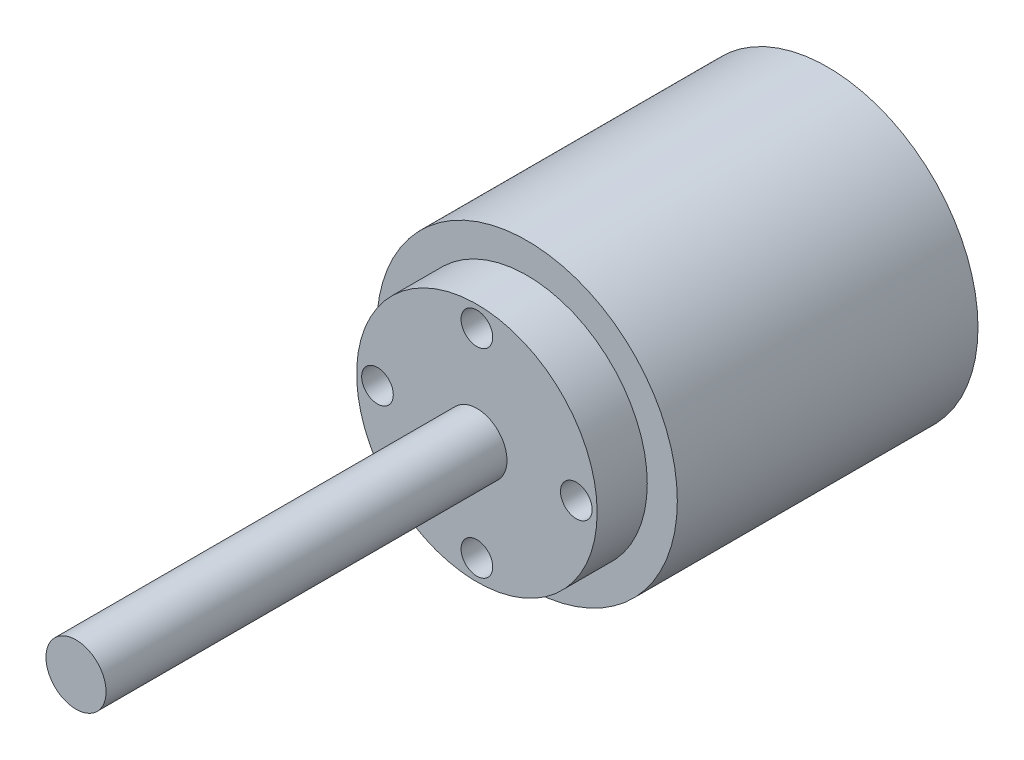
ISO-10303-21;
HEADER;
FILE_DESCRIPTION(('STEP AP214'),'2;1');
FILE_NAME('part.step','',(''),(''),'','','');
FILE_SCHEMA(('AUTOMOTIVE_DESIGN { 1 0 10303 214 1 1 1 1 }'));
ENDSEC;
DATA;
#1=APPLICATION_CONTEXT('core data for automotive mechanical design processes');
#2=APPLICATION_PROTOCOL_DEFINITION('international standard','automotive_design',2000,#1);
#3=PRODUCT_CONTEXT('',#1,'mechanical');
#4=PRODUCT('Part','Part','',(#3));
#5=PRODUCT_RELATED_PRODUCT_CATEGORY('part','',(#4));
#6=PRODUCT_DEFINITION_FORMATION('','',#4);
#7=PRODUCT_DEFINITION_CONTEXT('part definition',#1,'design');
#8=PRODUCT_DEFINITION('design','',#6,#7);
#9=PRODUCT_DEFINITION_SHAPE('','',#8);
#10=(LENGTH_UNIT() NAMED_UNIT(*) SI_UNIT(.MILLI.,.METRE.));
#11=(NAMED_UNIT(*) PLANE_ANGLE_UNIT() SI_UNIT($,.RADIAN.));
#12=(NAMED_UNIT(*) SI_UNIT($,.STERADIAN.) SOLID_ANGLE_UNIT());
#13=UNCERTAINTY_MEASURE_WITH_UNIT(LENGTH_MEASURE(1.E-05),#10,'distance_accuracy_value','');
#14=(GEOMETRIC_REPRESENTATION_CONTEXT(3) GLOBAL_UNCERTAINTY_ASSIGNED_CONTEXT((#13)) GLOBAL_UNIT_ASSIGNED_CONTEXT((#10,
#11,#12)) REPRESENTATION_CONTEXT('',''));
#15=CARTESIAN_POINT('',(0.,0.,0.));
#16=DIRECTION('',(0.,0.,1.));
#17=DIRECTION('',(1.,0.,0.));
#18=AXIS2_PLACEMENT_3D('',#15,#16,#17);
#19=CARTESIAN_POINT('',(5.17868932497556,-6.92509433962264,35.));
#20=DIRECTION('',(0.,0.,1.));
#21=DIRECTION('',(1.,0.,0.));
#22=AXIS2_PLACEMENT_3D('',#19,#20,#21);
#23=PLANE('',#22);
#24=CARTESIAN_POINT('',(5.17868932497556,-6.92509433962264,35.));
#25=DIRECTION('',(0.,0.,1.));
#26=DIRECTION('',(1.,0.,0.));
#27=AXIS2_PLACEMENT_3D('',#24,#25,#26);
#28=CIRCLE('',#27,12.);
#29=CARTESIAN_POINT('',(17.1786893249756,-6.92509433962264,35.));
#30=VERTEX_POINT('',#29);
#31=EDGE_CURVE('E44',#30,#30,#28,.T.);
#32=ORIENTED_EDGE('',*,*,#31,.T.);
#33=EDGE_LOOP('',(#32));
#34=FACE_BOUND('',#33,.T.);
#35=CARTESIAN_POINT('',(5.17868932497556,2.99560998384455,35.));
#36=DIRECTION('',(0.,0.,1.));
#37=DIRECTION('',(1.,0.,0.));
#38=AXIS2_PLACEMENT_3D('',#35,#36,#37);
#39=CIRCLE('',#38,1.5792956765328);
#40=CARTESIAN_POINT('',(6.75798500150836,2.99560998384455,35.));
#41=VERTEX_POINT('',#40);
#42=EDGE_CURVE('E52',#41,#41,#39,.T.);
#43=ORIENTED_EDGE('',*,*,#42,.F.);
#44=EDGE_LOOP('',(#43));
#45=FACE_BOUND('',#44,.T.);
#46=CARTESIAN_POINT('',(15.0993936484429,-6.92509433962254,35.));
#47=DIRECTION('',(0.,0.,1.));
#48=DIRECTION('',(1.,0.,0.));
#49=AXIS2_PLACEMENT_3D('',#46,#47,#48);
#50=CIRCLE('',#49,1.5792956765328);
#51=CARTESIAN_POINT('',(16.6786893249757,-6.92509433962254,35.));
#52=VERTEX_POINT('',#51);
#53=EDGE_CURVE('E58',#52,#52,#50,.T.);
#54=ORIENTED_EDGE('',*,*,#53,.F.);
#55=EDGE_LOOP('',(#54));
#56=FACE_BOUND('',#55,.T.);
#57=CARTESIAN_POINT('',(5.17868932497577,-16.8457986630898,35.));
#58=DIRECTION('',(0.,0.,1.));
#59=DIRECTION('',(1.,0.,0.));
#60=AXIS2_PLACEMENT_3D('',#57,#58,#59);
#61=CIRCLE('',#60,1.5792956765328);
#62=CARTESIAN_POINT('',(6.75798500150857,-16.8457986630898,35.));
#63=VERTEX_POINT('',#62);
#64=EDGE_CURVE('E64',#63,#63,#61,.T.);
#65=ORIENTED_EDGE('',*,*,#64,.F.);
#66=EDGE_LOOP('',(#65));
#67=FACE_BOUND('',#66,.T.);
#68=CARTESIAN_POINT('',(-4.7420149984915,-6.92509433962268,35.));
#69=DIRECTION('',(0.,0.,1.));
#70=DIRECTION('',(1.,0.,0.));
#71=AXIS2_PLACEMENT_3D('',#68,#69,#70);
#72=CIRCLE('',#71,1.5792956765328);
#73=CARTESIAN_POINT('',(-3.1627193219587,-6.92509433962268,35.));
#74=VERTEX_POINT('',#73);
#75=EDGE_CURVE('E70',#74,#74,#72,.T.);
#76=ORIENTED_EDGE('',*,*,#75,.F.);
#77=EDGE_LOOP('',(#76));
#78=FACE_BOUND('',#77,.T.);
#79=CARTESIAN_POINT('',(5.17868932497556,-6.92509433962264,35.));
#80=DIRECTION('',(0.,0.,1.));
#81=DIRECTION('',(1.,0.,0.));
#82=AXIS2_PLACEMENT_3D('',#79,#80,#81);
#83=CIRCLE('',#82,3.);
#84=CARTESIAN_POINT('',(8.17868932497556,-6.92509433962264,35.));
#85=VERTEX_POINT('',#84);
#86=EDGE_CURVE('E76',#85,#85,#83,.T.);
#87=ORIENTED_EDGE('',*,*,#86,.F.);
#88=EDGE_LOOP('',(#87));
#89=FACE_BOUND('',#88,.T.);
#90=ADVANCED_FACE('F33',(#34,#45,#56,#67,#78,#89),#23,.T.);
#91=CARTESIAN_POINT('',(5.17868932497556,-6.92509433962264,30.));
#92=DIRECTION('',(0.,0.,1.));
#93=DIRECTION('',(1.,0.,0.));
#94=AXIS2_PLACEMENT_3D('',#91,#92,#93);
#95=PLANE('',#94);
#96=CARTESIAN_POINT('',(5.17868932497556,-6.92509433962264,30.));
#97=DIRECTION('',(0.,0.,1.));
#98=DIRECTION('',(1.,0.,0.));
#99=AXIS2_PLACEMENT_3D('',#96,#97,#98);
#100=CIRCLE('',#99,15.);
#101=CARTESIAN_POINT('',(20.1786893249756,-6.92509433962264,30.));
#102=VERTEX_POINT('',#101);
#103=EDGE_CURVE('E10',#102,#102,#100,.T.);
#104=ORIENTED_EDGE('',*,*,#103,.T.);
#105=EDGE_LOOP('',(#104));
#106=FACE_BOUND('',#105,.T.);
#107=CARTESIAN_POINT('',(5.17868932497556,-6.92509433962264,30.));
#108=DIRECTION('',(0.,0.,1.));
#109=DIRECTION('',(1.,0.,0.));
#110=AXIS2_PLACEMENT_3D('',#107,#108,#109);
#111=CIRCLE('',#110,12.);
#112=CARTESIAN_POINT('',(17.1786893249756,-6.92509433962264,30.));
#113=VERTEX_POINT('',#112);
#114=EDGE_CURVE('E46',#113,#113,#111,.T.);
#115=ORIENTED_EDGE('',*,*,#114,.F.);
#116=EDGE_LOOP('',(#115));
#117=FACE_BOUND('',#116,.T.);
#118=ADVANCED_FACE('F92',(#106,#117),#95,.T.);
#119=CARTESIAN_POINT('',(5.17868932497556,-6.92509433962264,30.));
#120=DIRECTION('',(0.,0.,-1.));
#121=DIRECTION('',(-1.,0.,0.));
#122=AXIS2_PLACEMENT_3D('',#119,#120,#121);
#123=CYLINDRICAL_SURFACE('',#122,15.);
#124=ORIENTED_EDGE('',*,*,#103,.F.);
#125=EDGE_LOOP('',(#124));
#126=FACE_BOUND('',#125,.T.);
#127=CARTESIAN_POINT('',(5.17868932497556,-6.92509433962264,0.));
#128=DIRECTION('',(0.,0.,1.));
#129=DIRECTION('',(1.,0.,0.));
#130=AXIS2_PLACEMENT_3D('',#127,#128,#129);
#131=CIRCLE('',#130,15.);
#132=CARTESIAN_POINT('',(20.1786893249756,-6.92509433962264,0.));
#133=VERTEX_POINT('',#132);
#134=EDGE_CURVE('E37',#133,#133,#131,.T.);
#135=ORIENTED_EDGE('',*,*,#134,.T.);
#136=EDGE_LOOP('',(#135));
#137=FACE_BOUND('',#136,.T.);
#138=ADVANCED_FACE('F35',(#126,#137),#123,.T.);
#139=CARTESIAN_POINT('',(5.17868932497556,-6.92509433962264,0.));
#140=DIRECTION('',(0.,0.,1.));
#141=DIRECTION('',(1.,0.,0.));
#142=AXIS2_PLACEMENT_3D('',#139,#140,#141);
#143=PLANE('',#142);
#144=ORIENTED_EDGE('',*,*,#134,.F.);
#145=EDGE_LOOP('',(#144));
#146=FACE_BOUND('',#145,.T.);
#147=ADVANCED_FACE('F106',(#146),#143,.F.);
#148=CARTESIAN_POINT('',(5.17868932497556,-6.92509433962264,35.));
#149=DIRECTION('',(0.,0.,-1.));
#150=DIRECTION('',(-1.,0.,0.));
#151=AXIS2_PLACEMENT_3D('',#148,#149,#150);
#152=CYLINDRICAL_SURFACE('',#151,12.);
#153=ORIENTED_EDGE('',*,*,#31,.F.);
#154=EDGE_LOOP('',(#153));
#155=FACE_BOUND('',#154,.T.);
#156=ORIENTED_EDGE('',*,*,#114,.T.);
#157=EDGE_LOOP('',(#156));
#158=FACE_BOUND('',#157,.T.);
#159=ADVANCED_FACE('F104',(#155,#158),#152,.T.);
#160=CARTESIAN_POINT('',(5.17868932497556,2.99560998384455,32.));
#161=DIRECTION('',(0.,0.,1.));
#162=DIRECTION('',(1.,0.,0.));
#163=AXIS2_PLACEMENT_3D('',#160,#161,#162);
#164=CYLINDRICAL_SURFACE('',#163,1.5792956765328);
#165=CARTESIAN_POINT('',(5.17868932497556,2.99560998384455,32.));
#166=DIRECTION('',(0.,0.,1.));
#167=DIRECTION('',(1.,0.,0.));
#168=AXIS2_PLACEMENT_3D('',#165,#166,#167);
#169=CIRCLE('',#168,1.5792956765328);
#170=CARTESIAN_POINT('',(6.75798500150836,2.99560998384455,32.));
#171=VERTEX_POINT('',#170);
#172=EDGE_CURVE('E49',#171,#171,#169,.T.);
#173=ORIENTED_EDGE('',*,*,#172,.F.);
#174=EDGE_LOOP('',(#173));
#175=FACE_BOUND('',#174,.T.);
#176=ORIENTED_EDGE('',*,*,#42,.T.);
#177=EDGE_LOOP('',(#176));
#178=FACE_BOUND('',#177,.T.);
#179=ADVANCED_FACE('F102',(#175,#178),#164,.F.);
#180=CARTESIAN_POINT('',(5.17868932497556,2.99560998384455,32.));
#181=DIRECTION('',(0.,0.,1.));
#182=DIRECTION('',(1.,0.,0.));
#183=AXIS2_PLACEMENT_3D('',#180,#181,#182);
#184=PLANE('',#183);
#185=ORIENTED_EDGE('',*,*,#172,.T.);
#186=EDGE_LOOP('',(#185));
#187=FACE_BOUND('',#186,.T.);
#188=ADVANCED_FACE('F140',(#187),#184,.T.);
#189=CARTESIAN_POINT('',(15.0993936484429,-6.92509433962254,32.));
#190=DIRECTION('',(0.,0.,1.));
#191=DIRECTION('',(1.,0.,0.));
#192=AXIS2_PLACEMENT_3D('',#189,#190,#191);
#193=CYLINDRICAL_SURFACE('',#192,1.5792956765328);
#194=CARTESIAN_POINT('',(15.0993936484429,-6.92509433962254,32.));
#195=DIRECTION('',(0.,0.,1.));
#196=DIRECTION('',(1.,0.,0.));
#197=AXIS2_PLACEMENT_3D('',#194,#195,#196);
#198=CIRCLE('',#197,1.5792956765328);
#199=CARTESIAN_POINT('',(16.6786893249757,-6.92509433962254,32.));
#200=VERTEX_POINT('',#199);
#201=EDGE_CURVE('E55',#200,#200,#198,.T.);
#202=ORIENTED_EDGE('',*,*,#201,.F.);
#203=EDGE_LOOP('',(#202));
#204=FACE_BOUND('',#203,.T.);
#205=ORIENTED_EDGE('',*,*,#53,.T.);
#206=EDGE_LOOP('',(#205));
#207=FACE_BOUND('',#206,.T.);
#208=ADVANCED_FACE('F149',(#204,#207),#193,.F.);
#209=CARTESIAN_POINT('',(15.0993936484429,-6.92509433962254,32.));
#210=DIRECTION('',(0.,0.,1.));
#211=DIRECTION('',(1.,0.,0.));
#212=AXIS2_PLACEMENT_3D('',#209,#210,#211);
#213=PLANE('',#212);
#214=ORIENTED_EDGE('',*,*,#201,.T.);
#215=EDGE_LOOP('',(#214));
#216=FACE_BOUND('',#215,.T.);
#217=ADVANCED_FACE('F158',(#216),#213,.T.);
#218=CARTESIAN_POINT('',(5.17868932497577,-16.8457986630898,32.));
#219=DIRECTION('',(0.,0.,1.));
#220=DIRECTION('',(1.,0.,0.));
#221=AXIS2_PLACEMENT_3D('',#218,#219,#220);
#222=CYLINDRICAL_SURFACE('',#221,1.5792956765328);
#223=CARTESIAN_POINT('',(5.17868932497577,-16.8457986630898,32.));
#224=DIRECTION('',(0.,0.,1.));
#225=DIRECTION('',(1.,0.,0.));
#226=AXIS2_PLACEMENT_3D('',#223,#224,#225);
#227=CIRCLE('',#226,1.5792956765328);
#228=CARTESIAN_POINT('',(6.75798500150857,-16.8457986630898,32.));
#229=VERTEX_POINT('',#228);
#230=EDGE_CURVE('E61',#229,#229,#227,.T.);
#231=ORIENTED_EDGE('',*,*,#230,.F.);
#232=EDGE_LOOP('',(#231));
#233=FACE_BOUND('',#232,.T.);
#234=ORIENTED_EDGE('',*,*,#64,.T.);
#235=EDGE_LOOP('',(#234));
#236=FACE_BOUND('',#235,.T.);
#237=ADVANCED_FACE('F168',(#233,#236),#222,.F.);
#238=CARTESIAN_POINT('',(5.17868932497577,-16.8457986630898,32.));
#239=DIRECTION('',(0.,0.,1.));
#240=DIRECTION('',(1.,0.,0.));
#241=AXIS2_PLACEMENT_3D('',#238,#239,#240);
#242=PLANE('',#241);
#243=ORIENTED_EDGE('',*,*,#230,.T.);
#244=EDGE_LOOP('',(#243));
#245=FACE_BOUND('',#244,.T.);
#246=ADVANCED_FACE('F178',(#245),#242,.T.);
#247=CARTESIAN_POINT('',(-4.7420149984915,-6.92509433962268,32.));
#248=DIRECTION('',(0.,0.,1.));
#249=DIRECTION('',(1.,0.,0.));
#250=AXIS2_PLACEMENT_3D('',#247,#248,#249);
#251=CYLINDRICAL_SURFACE('',#250,1.5792956765328);
#252=CARTESIAN_POINT('',(-4.7420149984915,-6.92509433962268,32.));
#253=DIRECTION('',(0.,0.,1.));
#254=DIRECTION('',(1.,0.,0.));
#255=AXIS2_PLACEMENT_3D('',#252,#253,#254);
#256=CIRCLE('',#255,1.5792956765328);
#257=CARTESIAN_POINT('',(-3.1627193219587,-6.92509433962268,32.));
#258=VERTEX_POINT('',#257);
#259=EDGE_CURVE('E67',#258,#258,#256,.T.);
#260=ORIENTED_EDGE('',*,*,#259,.F.);
#261=EDGE_LOOP('',(#260));
#262=FACE_BOUND('',#261,.T.);
#263=ORIENTED_EDGE('',*,*,#75,.T.);
#264=EDGE_LOOP('',(#263));
#265=FACE_BOUND('',#264,.T.);
#266=ADVANCED_FACE('F188',(#262,#265),#251,.F.);
#267=CARTESIAN_POINT('',(-4.7420149984915,-6.92509433962268,32.));
#268=DIRECTION('',(0.,0.,1.));
#269=DIRECTION('',(1.,0.,0.));
#270=AXIS2_PLACEMENT_3D('',#267,#268,#269);
#271=PLANE('',#270);
#272=ORIENTED_EDGE('',*,*,#259,.T.);
#273=EDGE_LOOP('',(#272));
#274=FACE_BOUND('',#273,.T.);
#275=ADVANCED_FACE('F87',(#274),#271,.T.);
#276=CARTESIAN_POINT('',(5.17868932497556,-6.92509433962264,75.));
#277=DIRECTION('',(0.,0.,-1.));
#278=DIRECTION('',(-1.,0.,0.));
#279=AXIS2_PLACEMENT_3D('',#276,#277,#278);
#280=CYLINDRICAL_SURFACE('',#279,3.);
#281=CARTESIAN_POINT('',(5.17868932497556,-6.92509433962264,75.));
#282=DIRECTION('',(0.,0.,1.));
#283=DIRECTION('',(1.,0.,0.));
#284=AXIS2_PLACEMENT_3D('',#281,#282,#283);
#285=CIRCLE('',#284,3.);
#286=CARTESIAN_POINT('',(8.17868932497556,-6.92509433962264,75.));
#287=VERTEX_POINT('',#286);
#288=EDGE_CURVE('E73',#287,#287,#285,.T.);
#289=ORIENTED_EDGE('',*,*,#288,.F.);
#290=EDGE_LOOP('',(#289));
#291=FACE_BOUND('',#290,.T.);
#292=ORIENTED_EDGE('',*,*,#86,.T.);
#293=EDGE_LOOP('',(#292));
#294=FACE_BOUND('',#293,.T.);
#295=ADVANCED_FACE('F84',(#291,#294),#280,.T.);
#296=CARTESIAN_POINT('',(5.17868932497556,-6.92509433962264,75.));
#297=DIRECTION('',(0.,0.,1.));
#298=DIRECTION('',(1.,0.,0.));
#299=AXIS2_PLACEMENT_3D('',#296,#297,#298);
#300=PLANE('',#299);
#301=ORIENTED_EDGE('',*,*,#288,.T.);
#302=EDGE_LOOP('',(#301));
#303=FACE_BOUND('',#302,.T.);
#304=ADVANCED_FACE('F82',(#303),#300,.T.);
#305=CLOSED_SHELL('',(#90,#118,#138,#147,#159,#179,#188,#208,#217,#237,#246,#266,#275,#295,#304));
#306=MANIFOLD_SOLID_BREP('B2',#305);
#307=ADVANCED_BREP_SHAPE_REPRESENTATION('',(#18,#306),#14);
#308=SHAPE_DEFINITION_REPRESENTATION(#9,#307);
ENDSEC;
END-ISO-10303-21;
